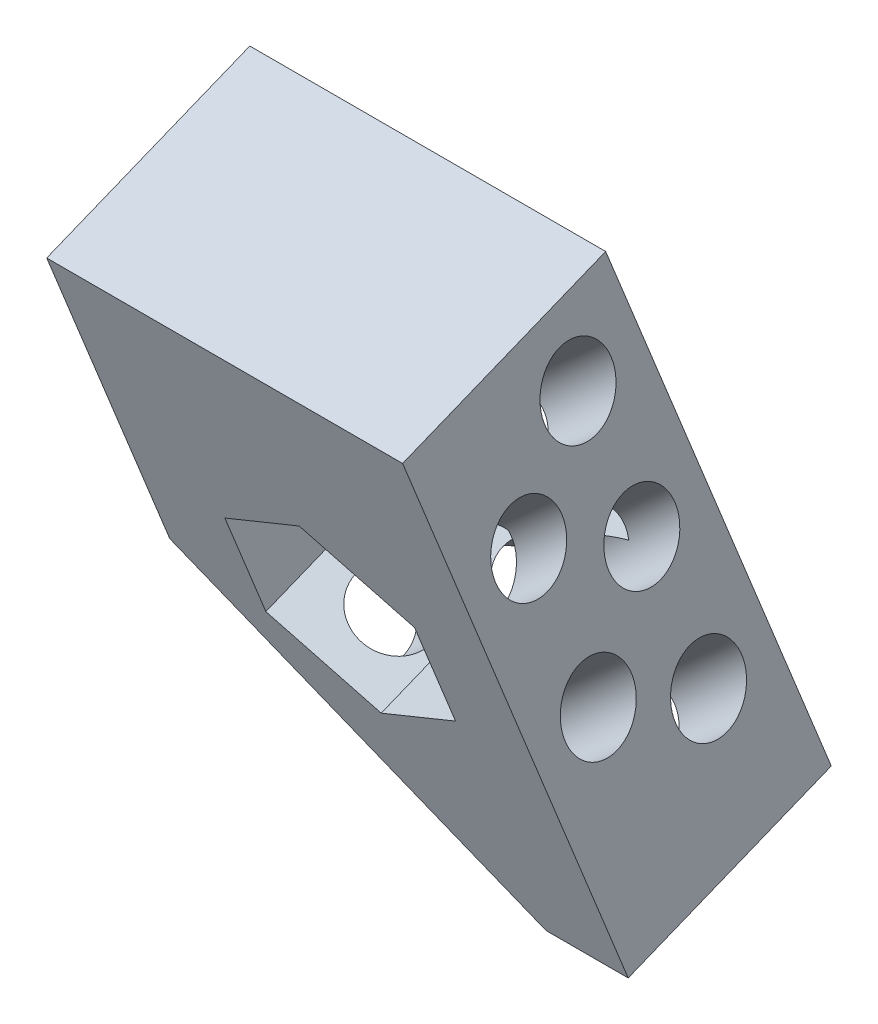
ISO-10303-21;
HEADER;
FILE_DESCRIPTION(('STEP AP214'),'2;1');
FILE_NAME('part.step','',(''),(''),'','','');
FILE_SCHEMA(('AUTOMOTIVE_DESIGN { 1 0 10303 214 1 1 1 1 }'));
ENDSEC;
DATA;
#1=APPLICATION_CONTEXT('core data for automotive mechanical design processes');
#2=APPLICATION_PROTOCOL_DEFINITION('international standard','automotive_design',2000,#1);
#3=PRODUCT_CONTEXT('',#1,'mechanical');
#4=PRODUCT('Part','Part','',(#3));
#5=PRODUCT_RELATED_PRODUCT_CATEGORY('part','',(#4));
#6=PRODUCT_DEFINITION_FORMATION('','',#4);
#7=PRODUCT_DEFINITION_CONTEXT('part definition',#1,'design');
#8=PRODUCT_DEFINITION('design','',#6,#7);
#9=PRODUCT_DEFINITION_SHAPE('','',#8);
#10=(LENGTH_UNIT() NAMED_UNIT(*) SI_UNIT(.MILLI.,.METRE.));
#11=(NAMED_UNIT(*) PLANE_ANGLE_UNIT() SI_UNIT($,.RADIAN.));
#12=(NAMED_UNIT(*) SI_UNIT($,.STERADIAN.) SOLID_ANGLE_UNIT());
#13=UNCERTAINTY_MEASURE_WITH_UNIT(LENGTH_MEASURE(1.E-05),#10,'distance_accuracy_value','');
#14=(GEOMETRIC_REPRESENTATION_CONTEXT(3) GLOBAL_UNCERTAINTY_ASSIGNED_CONTEXT((#13)) GLOBAL_UNIT_ASSIGNED_CONTEXT((#10,
#11,#12)) REPRESENTATION_CONTEXT('',''));
#15=CARTESIAN_POINT('',(0.,0.,0.));
#16=DIRECTION('',(0.,0.,1.));
#17=DIRECTION('',(1.,0.,0.));
#18=AXIS2_PLACEMENT_3D('',#15,#16,#17);
#19=CARTESIAN_POINT('',(22.8313600154402,-3.79206875254151,-14.4745121383278));
#20=DIRECTION('',(-0.707106781186546,-0.655617990970857,-0.264886862481586));
#21=DIRECTION('',(0.679904521866933,-0.733300648537076,0.));
#22=AXIS2_PLACEMENT_3D('',#19,#20,#21);
#23=CYLINDRICAL_SURFACE('',#22,6.50000000000001);
#24=CARTESIAN_POINT('',(-39.1198183419776,-61.2322010969268,-37.681832020902));
#25=DIRECTION('',(-0.5,-0.802964772033613,-0.324418826323332));
#26=DIRECTION('',(-0.866025403784439,0.463591927283392,0.187303296707959));
#27=AXIS2_PLACEMENT_3D('',#24,#25,#26);
#28=ELLIPSE('',#27,6.72929517266554,6.50000000000001);
#29=CARTESIAN_POINT('',(-44.94755891107,-58.1125541785719,-36.4214128505408));
#30=VERTEX_POINT('',#29);
#31=EDGE_CURVE('E177',#30,#30,#28,.F.);
#32=ORIENTED_EDGE('',*,*,#31,.T.);
#33=EDGE_LOOP('',(#32));
#34=FACE_BOUND('',#33,.T.);
#35=CARTESIAN_POINT('',(-46.6152236891497,-68.1818199182584,-40.4896602842776));
#36=DIRECTION('',(-0.707106781186546,-0.655617990970857,-0.264886862481586));
#37=DIRECTION('',(0.679904521866933,-0.733300648537077,0.));
#38=AXIS2_PLACEMENT_3D('',#35,#36,#37);
#39=CIRCLE('',#38,6.50000000000001);
#40=CARTESIAN_POINT('',(-42.1958442970147,-72.9482741337494,-40.4896602842776));
#41=VERTEX_POINT('',#40);
#42=EDGE_CURVE('E220',#41,#41,#39,.T.);
#43=ORIENTED_EDGE('',*,*,#42,.T.);
#44=EDGE_LOOP('',(#43));
#45=FACE_BOUND('',#44,.T.);
#46=ADVANCED_FACE('F35',(#34,#45),#23,.F.);
#47=CARTESIAN_POINT('',(15.0531854223881,9.41343464279255,-26.395698324099));
#48=DIRECTION('',(-0.707106781186546,-0.655617990970857,-0.264886862481586));
#49=DIRECTION('',(0.679904521866933,-0.733300648537076,0.));
#50=AXIS2_PLACEMENT_3D('',#47,#48,#49);
#51=CYLINDRICAL_SURFACE('',#50,6.50000000000001);
#52=CARTESIAN_POINT('',(-23.6231646872038,-26.4466527323936,-40.8841140844146));
#53=DIRECTION('',(0.5,0.802964772033613,0.324418826323332));
#54=DIRECTION('',(-0.866025403784439,0.463591927283393,0.187303296707959));
#55=AXIS2_PLACEMENT_3D('',#52,#53,#54);
#56=ELLIPSE('',#55,6.72929517266554,6.50000000000001);
#57=CARTESIAN_POINT('',(-29.4509052562962,-23.3270058140387,-39.6236949140533));
#58=VERTEX_POINT('',#57);
#59=EDGE_CURVE('E196',#58,#58,#56,.F.);
#60=ORIENTED_EDGE('',*,*,#59,.T.);
#61=EDGE_LOOP('',(#60));
#62=FACE_BOUND('',#61,.T.);
#63=CARTESIAN_POINT('',(0.,-4.54363584064589,-32.0347208352379));
#64=DIRECTION('',(-1.,0.,0.));
#65=DIRECTION('',(0.,-0.927183854566786,-0.374606593415916));
#66=AXIS2_PLACEMENT_3D('',#63,#64,#65);
#67=ELLIPSE('',#66,9.19238815542515,6.50000000000001);
#68=CARTESIAN_POINT('',(0.,-13.066669723267,-35.4782500474986));
#69=VERTEX_POINT('',#68);
#70=EDGE_CURVE('E217',#69,#69,#67,.T.);
#71=ORIENTED_EDGE('',*,*,#70,.F.);
#72=EDGE_LOOP('',(#71));
#73=FACE_BOUND('',#72,.T.);
#74=ADVANCED_FACE('F350',(#62,#73),#51,.F.);
#75=CARTESIAN_POINT('',(0.,14.9842637366366,-37.0873541826714));
#76=DIRECTION('',(0.,-0.927183854566786,-0.374606593415916));
#77=DIRECTION('',(0.,0.374606593415916,-0.927183854566786));
#78=AXIS2_PLACEMENT_3D('',#75,#76,#77);
#79=PLANE('',#78);
#80=DIRECTION('',(1.,0.,0.));
#81=VECTOR('',#80,1.);
#82=CARTESIAN_POINT('',(0.,0.,0.));
#83=LINE('',#82,#81);
#84=CARTESIAN_POINT('',(-65.,0.,0.));
#85=VERTEX_POINT('',#84);
#86=CARTESIAN_POINT('',(0.,0.,0.));
#87=VERTEX_POINT('',#86);
#88=EDGE_CURVE('E238',#85,#87,#83,.T.);
#89=ORIENTED_EDGE('',*,*,#88,.T.);
#90=DIRECTION('',(0.,-0.374606593415916,0.927183854566786));
#91=VECTOR('',#90,1.);
#92=CARTESIAN_POINT('',(0.,14.9842637366366,-37.0873541826714));
#93=LINE('',#92,#91);
#94=CARTESIAN_POINT('',(0.,14.9842637366366,-37.0873541826714));
#95=VERTEX_POINT('',#94);
#96=EDGE_CURVE('E264',#95,#87,#93,.T.);
#97=ORIENTED_EDGE('',*,*,#96,.F.);
#98=DIRECTION('',(1.,0.,0.));
#99=VECTOR('',#98,1.);
#100=CARTESIAN_POINT('',(0.,14.9842637366366,-37.0873541826714));
#101=LINE('',#100,#99);
#102=CARTESIAN_POINT('',(-65.,14.9842637366366,-37.0873541826714));
#103=VERTEX_POINT('',#102);
#104=EDGE_CURVE('E239',#103,#95,#101,.T.);
#105=ORIENTED_EDGE('',*,*,#104,.F.);
#106=DIRECTION('',(0.,-0.374606593415916,0.927183854566786));
#107=VECTOR('',#106,1.);
#108=CARTESIAN_POINT('',(-65.,14.9842637366366,-37.0873541826714));
#109=LINE('',#108,#107);
#110=EDGE_CURVE('E250',#103,#85,#109,.T.);
#111=ORIENTED_EDGE('',*,*,#110,.T.);
#112=EDGE_LOOP('',(#89,#97,#105,#111));
#113=FACE_BOUND('',#112,.T.);
#114=ADVANCED_FACE('F325',(#113),#79,.F.);
#115=CARTESIAN_POINT('',(0.,14.9842637366366,-37.0873541826714));
#116=DIRECTION('',(-1.,0.,0.));
#117=DIRECTION('',(0.,0.,1.));
#118=AXIS2_PLACEMENT_3D('',#115,#116,#117);
#119=PLANE('',#118);
#120=CARTESIAN_POINT('',(0.,-63.549255028023,-55.8745384585807));
#121=DIRECTION('',(-1.,0.,0.));
#122=DIRECTION('',(0.,-0.927183854566786,-0.374606593415916));
#123=AXIS2_PLACEMENT_3D('',#120,#121,#122);
#124=ELLIPSE('',#123,9.19238815542511,6.49999999999998);
#125=CARTESIAN_POINT('',(0.,-72.0722889106441,-59.3180676708413));
#126=VERTEX_POINT('',#125);
#127=EDGE_CURVE('E211',#126,#126,#124,.T.);
#128=ORIENTED_EDGE('',*,*,#127,.T.);
#129=EDGE_LOOP('',(#128));
#130=FACE_BOUND('',#129,.T.);
#131=ORIENTED_EDGE('',*,*,#70,.T.);
#132=EDGE_LOOP('',(#131));
#133=FACE_BOUND('',#132,.T.);
#134=CARTESIAN_POINT('',(0.,-24.9609371366594,-23.0272901367643));
#135=DIRECTION('',(-1.,0.,0.));
#136=DIRECTION('',(0.,-0.927183854566786,-0.374606593415916));
#137=AXIS2_PLACEMENT_3D('',#134,#135,#136);
#138=ELLIPSE('',#137,9.19238815542515,6.50000000000001);
#139=CARTESIAN_POINT('',(0.,-33.4839710192806,-26.4708193490249));
#140=VERTEX_POINT('',#139);
#141=EDGE_CURVE('E223',#140,#140,#138,.T.);
#142=ORIENTED_EDGE('',*,*,#141,.T.);
#143=EDGE_LOOP('',(#142));
#144=FACE_BOUND('',#143,.T.);
#145=CARTESIAN_POINT('',(0.,-33.3908274433636,-43.6897427844278));
#146=DIRECTION('',(-1.,0.,0.));
#147=DIRECTION('',(0.,-0.927183854566786,-0.374606593415916));
#148=AXIS2_PLACEMENT_3D('',#145,#146,#147);
#149=ELLIPSE('',#148,9.19238815542515,6.50000000000001);
#150=CARTESIAN_POINT('',(0.,-41.9138613259848,-47.1332719966884));
#151=VERTEX_POINT('',#150);
#152=EDGE_CURVE('E229',#151,#151,#149,.T.);
#153=ORIENTED_EDGE('',*,*,#152,.T.);
#154=EDGE_LOOP('',(#153));
#155=FACE_BOUND('',#154,.T.);
#156=CARTESIAN_POINT('',(0.,-56.4306007032606,-35.7418595358804));
#157=DIRECTION('',(-1.,0.,0.));
#158=DIRECTION('',(0.,-0.927183854566786,-0.374606593415916));
#159=AXIS2_PLACEMENT_3D('',#156,#157,#158);
#160=ELLIPSE('',#159,9.19238815542515,6.50000000000001);
#161=CARTESIAN_POINT('',(0.,-64.9536345858817,-39.185388748141));
#162=VERTEX_POINT('',#161);
#163=EDGE_CURVE('E235',#162,#162,#160,.T.);
#164=ORIENTED_EDGE('',*,*,#163,.T.);
#165=EDGE_LOOP('',(#164));
#166=FACE_BOUND('',#165,.T.);
#167=DIRECTION('',(0.,-0.927183854566786,-0.374606593415916));
#168=VECTOR('',#167,1.);
#169=CARTESIAN_POINT('',(0.,0.,0.));
#170=LINE('',#169,#168);
#171=CARTESIAN_POINT('',(0.,-101.990224002346,-41.2067252757508));
#172=VERTEX_POINT('',#171);
#173=EDGE_CURVE('E253',#87,#172,#170,.T.);
#174=ORIENTED_EDGE('',*,*,#173,.T.);
#175=DIRECTION('',(0.,-0.374606593415916,0.927183854566786));
#176=VECTOR('',#175,1.);
#177=CARTESIAN_POINT('',(0.,-87.0059602657098,-78.2940794584222));
#178=LINE('',#177,#176);
#179=CARTESIAN_POINT('',(0.,-87.0059602657098,-78.2940794584222));
#180=VERTEX_POINT('',#179);
#181=EDGE_CURVE('E261',#180,#172,#178,.T.);
#182=ORIENTED_EDGE('',*,*,#181,.F.);
#183=DIRECTION('',(0.,-0.927183854566786,-0.374606593415916));
#184=VECTOR('',#183,1.);
#185=CARTESIAN_POINT('',(0.,14.9842637366366,-37.0873541826714));
#186=LINE('',#185,#184);
#187=EDGE_CURVE('E242',#95,#180,#186,.T.);
#188=ORIENTED_EDGE('',*,*,#187,.F.);
#189=ORIENTED_EDGE('',*,*,#96,.T.);
#190=EDGE_LOOP('',(#174,#182,#188,#189));
#191=FACE_BOUND('',#190,.T.);
#192=ADVANCED_FACE('F321',(#130,#133,#144,#155,#166,#191),#119,.F.);
#193=CARTESIAN_POINT('',(0.,-87.0059602657098,-78.2940794584222));
#194=DIRECTION('',(0.,0.927183854566786,0.374606593415916));
#195=DIRECTION('',(0.,-0.374606593415916,0.927183854566786));
#196=AXIS2_PLACEMENT_3D('',#193,#194,#195);
#197=PLANE('',#196);
#198=DIRECTION('',(-1.,0.,0.));
#199=VECTOR('',#198,1.);
#200=CARTESIAN_POINT('',(0.,-101.990224002346,-41.2067252757508));
#201=LINE('',#200,#199);
#202=CARTESIAN_POINT('',(-14.9999999999998,-101.990224002346,-41.2067252757508));
#203=VERTEX_POINT('',#202);
#204=EDGE_CURVE('E255',#172,#203,#201,.T.);
#205=ORIENTED_EDGE('',*,*,#204,.T.);
#206=DIRECTION('',(0.,0.374606593415916,-0.927183854566786));
#207=VECTOR('',#206,1.);
#208=CARTESIAN_POINT('',(-14.9999999999998,-87.0059602657098,-78.2940794584222));
#209=LINE('',#208,#207);
#210=CARTESIAN_POINT('',(-14.9999999999998,-87.0059602657098,-78.2940794584222));
#211=VERTEX_POINT('',#210);
#212=EDGE_CURVE('E272',#203,#211,#209,.T.);
#213=ORIENTED_EDGE('',*,*,#212,.T.);
#214=DIRECTION('',(-1.,0.,0.));
#215=VECTOR('',#214,1.);
#216=CARTESIAN_POINT('',(0.,-87.0059602657098,-78.2940794584222));
#217=LINE('',#216,#215);
#218=EDGE_CURVE('E245',#180,#211,#217,.T.);
#219=ORIENTED_EDGE('',*,*,#218,.F.);
#220=ORIENTED_EDGE('',*,*,#181,.T.);
#221=EDGE_LOOP('',(#205,#213,#219,#220));
#222=FACE_BOUND('',#221,.T.);
#223=ADVANCED_FACE('F324',(#222),#197,.F.);
#224=CARTESIAN_POINT('',(-65.,14.9842637366366,-37.0873541826714));
#225=DIRECTION('',(1.,0.,0.));
#226=DIRECTION('',(0.,0.,-1.));
#227=AXIS2_PLACEMENT_3D('',#224,#225,#226);
#228=PLANE('',#227);
#229=DIRECTION('',(0.,0.927183854566786,0.374606593415916));
#230=VECTOR('',#229,1.);
#231=CARTESIAN_POINT('',(-65.,14.9842637366366,-37.0873541826714));
#232=LINE('',#231,#230);
#233=CARTESIAN_POINT('',(-65.,-40.6467675373705,-59.5637497876264));
#234=VERTEX_POINT('',#233);
#235=EDGE_CURVE('E248',#234,#103,#232,.T.);
#236=ORIENTED_EDGE('',*,*,#235,.F.);
#237=DIRECTION('',(0.,-0.374606593415916,0.927183854566786));
#238=VECTOR('',#237,1.);
#239=CARTESIAN_POINT('',(-65.,-40.6467675373705,-59.5637497876264));
#240=LINE('',#239,#238);
#241=CARTESIAN_POINT('',(-65.,-55.6310312740071,-22.476395604955));
#242=VERTEX_POINT('',#241);
#243=EDGE_CURVE('E267',#234,#242,#240,.T.);
#244=ORIENTED_EDGE('',*,*,#243,.T.);
#245=DIRECTION('',(0.,0.927183854566786,0.374606593415916));
#246=VECTOR('',#245,1.);
#247=CARTESIAN_POINT('',(-65.,0.,0.));
#248=LINE('',#247,#246);
#249=EDGE_CURVE('E243',#242,#85,#248,.T.);
#250=ORIENTED_EDGE('',*,*,#249,.T.);
#251=ORIENTED_EDGE('',*,*,#110,.F.);
#252=EDGE_LOOP('',(#236,#244,#250,#251));
#253=FACE_BOUND('',#252,.T.);
#254=ADVANCED_FACE('F345',(#253),#228,.F.);
#255=CARTESIAN_POINT('',(0.,14.9842637366366,-37.0873541826714));
#256=DIRECTION('',(0.,-0.374606593415916,0.927183854566786));
#257=DIRECTION('',(0.,-0.927183854566786,-0.374606593415916));
#258=AXIS2_PLACEMENT_3D('',#255,#256,#257);
#259=PLANE('',#258);
#260=DIRECTION('',(0.,-0.927183854566786,-0.374606593415916));
#261=VECTOR('',#260,1.);
#262=CARTESIAN_POINT('',(-14.6794919243113,-26.7390097188688,-53.9446508863877));
#263=LINE('',#262,#261);
#264=CARTESIAN_POINT('',(-14.6794919243113,-26.7390097188687,-53.9446508863877));
#265=VERTEX_POINT('',#264);
#266=CARTESIAN_POINT('',(-14.6794919243113,-45.2826868102045,-61.436782754706));
#267=VERTEX_POINT('',#266);
#268=EDGE_CURVE('E155',#265,#267,#263,.T.);
#269=ORIENTED_EDGE('',*,*,#268,.F.);
#270=DIRECTION('',(0.866025403784439,-0.463591927283393,-0.187303296707958));
#271=VECTOR('',#270,1.);
#272=CARTESIAN_POINT('',(-32.,-17.4671711732009,-50.1985849522285));
#273=LINE('',#272,#271);
#274=CARTESIAN_POINT('',(-32.,-17.4671711732009,-50.1985849522285));
#275=VERTEX_POINT('',#274);
#276=EDGE_CURVE('E50',#275,#265,#273,.T.);
#277=ORIENTED_EDGE('',*,*,#276,.F.);
#278=DIRECTION('',(0.866025403784439,0.463591927283393,0.187303296707958));
#279=VECTOR('',#278,1.);
#280=CARTESIAN_POINT('',(-49.3205080756888,-26.7390097188688,-53.9446508863877));
#281=LINE('',#280,#279);
#282=CARTESIAN_POINT('',(-49.3205080756888,-26.7390097188688,-53.9446508863877));
#283=VERTEX_POINT('',#282);
#284=EDGE_CURVE('E172',#283,#275,#281,.T.);
#285=ORIENTED_EDGE('',*,*,#284,.F.);
#286=DIRECTION('',(0.,0.927183854566786,0.374606593415916));
#287=VECTOR('',#286,1.);
#288=CARTESIAN_POINT('',(-49.3205080756888,-45.2826868102045,-61.436782754706));
#289=LINE('',#288,#287);
#290=CARTESIAN_POINT('',(-49.3205080756888,-45.2826868102045,-61.436782754706));
#291=VERTEX_POINT('',#290);
#292=EDGE_CURVE('E166',#291,#283,#289,.T.);
#293=ORIENTED_EDGE('',*,*,#292,.F.);
#294=DIRECTION('',(-0.866025403784439,0.463591927283393,0.187303296707958));
#295=VECTOR('',#294,1.);
#296=CARTESIAN_POINT('',(-32.,-54.5545253558723,-65.1828486888652));
#297=LINE('',#296,#295);
#298=CARTESIAN_POINT('',(-32.,-54.5545253558723,-65.1828486888652));
#299=VERTEX_POINT('',#298);
#300=EDGE_CURVE('E164',#299,#291,#297,.T.);
#301=ORIENTED_EDGE('',*,*,#300,.F.);
#302=DIRECTION('',(-0.866025403784438,-0.463591927283393,-0.187303296707958));
#303=VECTOR('',#302,1.);
#304=CARTESIAN_POINT('',(-14.6794919243113,-45.2826868102045,-61.436782754706));
#305=LINE('',#304,#303);
#306=EDGE_CURVE('E147',#267,#299,#305,.T.);
#307=ORIENTED_EDGE('',*,*,#306,.F.);
#308=EDGE_LOOP('',(#269,#277,#285,#293,#301,#307));
#309=FACE_BOUND('',#308,.T.);
#310=ORIENTED_EDGE('',*,*,#218,.T.);
#311=DIRECTION('',(0.707106781186549,-0.655617990970855,-0.264886862481586));
#312=VECTOR('',#311,1.);
#313=CARTESIAN_POINT('',(-65.,-40.6467675373705,-59.5637497876264));
#314=LINE('',#313,#312);
#315=EDGE_CURVE('E274',#211,#234,#314,.F.);
#316=ORIENTED_EDGE('',*,*,#315,.T.);
#317=ORIENTED_EDGE('',*,*,#235,.T.);
#318=ORIENTED_EDGE('',*,*,#104,.T.);
#319=ORIENTED_EDGE('',*,*,#187,.T.);
#320=EDGE_LOOP('',(#310,#316,#317,#318,#319));
#321=FACE_BOUND('',#320,.T.);
#322=ADVANCED_FACE('F160',(#309,#321),#259,.F.);
#323=CARTESIAN_POINT('',(0.,0.,0.));
#324=DIRECTION('',(0.,-0.374606593415916,0.927183854566786));
#325=DIRECTION('',(0.,-0.927183854566786,-0.374606593415916));
#326=AXIS2_PLACEMENT_3D('',#323,#324,#325);
#327=PLANE('',#326);
#328=DIRECTION('',(-0.866025403784439,0.463591927283393,0.187303296707958));
#329=VECTOR('',#328,1.);
#330=CARTESIAN_POINT('',(-23.1554445662277,-37.186012534916,-15.0241242983411));
#331=LINE('',#330,#329);
#332=CARTESIAN_POINT('',(-14.6794919243113,-41.7232734555054,-16.8572967037162));
#333=VERTEX_POINT('',#332);
#334=CARTESIAN_POINT('',(-32.,-32.4514349098376,-13.1112307695571));
#335=VERTEX_POINT('',#334);
#336=EDGE_CURVE('E200',#333,#335,#331,.T.);
#337=ORIENTED_EDGE('',*,*,#336,.F.);
#338=DIRECTION('',(0.,0.927183854566786,0.374606593415916));
#339=VECTOR('',#338,1.);
#340=CARTESIAN_POINT('',(-14.6794919243113,0.,0.));
#341=LINE('',#340,#339);
#342=CARTESIAN_POINT('',(-14.6794919243113,-60.2669505468411,-24.3494285720346));
#343=VERTEX_POINT('',#342);
#344=EDGE_CURVE('E204',#343,#333,#341,.T.);
#345=ORIENTED_EDGE('',*,*,#344,.F.);
#346=DIRECTION('',(0.866025403784438,0.463591927283393,0.187303296707958));
#347=VECTOR('',#346,1.);
#348=CARTESIAN_POINT('',(24.4759526419165,-39.3066554668439,-15.880919658472));
#349=LINE('',#348,#347);
#350=CARTESIAN_POINT('',(-32.,-69.538789092509,-28.0954945061937));
#351=VERTEX_POINT('',#350);
#352=EDGE_CURVE('E206',#351,#343,#349,.T.);
#353=ORIENTED_EDGE('',*,*,#352,.F.);
#354=DIRECTION('',(0.866025403784439,-0.463591927283393,-0.187303296707958));
#355=VECTOR('',#354,1.);
#356=CARTESIAN_POINT('',(-40.4759526419164,-65.0015281719195,-26.2623221008186));
#357=LINE('',#356,#355);
#358=CARTESIAN_POINT('',(-49.3205080756888,-60.2669505468411,-24.3494285720345));
#359=VERTEX_POINT('',#358);
#360=EDGE_CURVE('E192',#359,#351,#357,.T.);
#361=ORIENTED_EDGE('',*,*,#360,.F.);
#362=DIRECTION('',(0.,-0.927183854566786,-0.374606593415916));
#363=VECTOR('',#362,1.);
#364=CARTESIAN_POINT('',(-49.3205080756888,0.,0.));
#365=LINE('',#364,#363);
#366=CARTESIAN_POINT('',(-49.3205080756888,-41.7232734555054,-16.8572967037162));
#367=VERTEX_POINT('',#366);
#368=EDGE_CURVE('E194',#367,#359,#365,.T.);
#369=ORIENTED_EDGE('',*,*,#368,.F.);
#370=DIRECTION('',(-0.866025403784439,-0.463591927283393,-0.187303296707958));
#371=VECTOR('',#370,1.);
#372=CARTESIAN_POINT('',(7.1554445662277,-11.4911398298404,-4.64272185599451));
#373=LINE('',#372,#371);
#374=EDGE_CURVE('E11',#335,#367,#373,.T.);
#375=ORIENTED_EDGE('',*,*,#374,.F.);
#376=EDGE_LOOP('',(#337,#345,#353,#361,#369,#375));
#377=FACE_BOUND('',#376,.T.);
#378=ORIENTED_EDGE('',*,*,#249,.F.);
#379=DIRECTION('',(-0.707106781186549,0.655617990970855,0.264886862481586));
#380=VECTOR('',#379,1.);
#381=CARTESIAN_POINT('',(-62.4999999999999,-57.9489909104242,-23.4129120884948));
#382=LINE('',#381,#380);
#383=EDGE_CURVE('E270',#242,#203,#382,.F.);
#384=ORIENTED_EDGE('',*,*,#383,.T.);
#385=ORIENTED_EDGE('',*,*,#204,.F.);
#386=ORIENTED_EDGE('',*,*,#173,.F.);
#387=ORIENTED_EDGE('',*,*,#88,.F.);
#388=EDGE_LOOP('',(#378,#384,#385,#386,#387));
#389=FACE_BOUND('',#388,.T.);
#390=ADVANCED_FACE('F304',(#377,#389),#327,.T.);
#391=CARTESIAN_POINT('',(-65.,-40.6467675373705,-59.5637497876264));
#392=DIRECTION('',(0.707106781186546,0.655617990970857,0.264886862481586));
#393=DIRECTION('',(0.,-0.374606593415916,0.927183854566786));
#394=AXIS2_PLACEMENT_3D('',#391,#392,#393);
#395=PLANE('',#394);
#396=CARTESIAN_POINT('',(-22.5735931288071,-84.4791261166127,-64.3307552817201));
#397=DIRECTION('',(-0.707106781186546,-0.655617990970857,-0.264886862481586));
#398=DIRECTION('',(0.679904521866933,-0.733300648537077,0.));
#399=AXIS2_PLACEMENT_3D('',#396,#397,#398);
#400=CIRCLE('',#399,6.49999999999998);
#401=CARTESIAN_POINT('',(-18.154213736672,-89.2455803321037,-64.3307552817201));
#402=VERTEX_POINT('',#401);
#403=EDGE_CURVE('E208',#402,#402,#400,.T.);
#404=ORIENTED_EDGE('',*,*,#403,.F.);
#405=EDGE_LOOP('',(#404));
#406=FACE_BOUND('',#405,.T.);
#407=CARTESIAN_POINT('',(-54.3933982822018,-54.9763165229243,-52.4108464700487));
#408=DIRECTION('',(-0.707106781186546,-0.655617990970857,-0.264886862481586));
#409=DIRECTION('',(0.679904521866933,-0.733300648537077,0.));
#410=AXIS2_PLACEMENT_3D('',#407,#408,#409);
#411=CIRCLE('',#410,6.50000000000001);
#412=CARTESIAN_POINT('',(-49.9740188900667,-59.7427707384153,-52.4108464700487));
#413=VERTEX_POINT('',#412);
#414=EDGE_CURVE('E214',#413,#413,#411,.T.);
#415=ORIENTED_EDGE('',*,*,#414,.F.);
#416=EDGE_LOOP('',(#415));
#417=FACE_BOUND('',#416,.T.);
#418=ORIENTED_EDGE('',*,*,#42,.F.);
#419=EDGE_LOOP('',(#418));
#420=FACE_BOUND('',#419,.T.);
#421=CARTESIAN_POINT('',(-38.8370490960977,-69.3999123242831,-58.2383574446436));
#422=DIRECTION('',(-0.707106781186546,-0.655617990970857,-0.264886862481586));
#423=DIRECTION('',(0.679904521866933,-0.733300648537077,0.));
#424=AXIS2_PLACEMENT_3D('',#421,#422,#423);
#425=CIRCLE('',#424,6.50000000000001);
#426=CARTESIAN_POINT('',(-34.4176697039626,-74.1663665397741,-58.2383574446436));
#427=VERTEX_POINT('',#426);
#428=EDGE_CURVE('E226',#427,#427,#425,.T.);
#429=ORIENTED_EDGE('',*,*,#428,.F.);
#430=EDGE_LOOP('',(#429));
#431=FACE_BOUND('',#430,.T.);
#432=CARTESIAN_POINT('',(-29.6446609406726,-83.9166517015589,-46.8469449838356));
#433=DIRECTION('',(-0.707106781186546,-0.655617990970857,-0.264886862481586));
#434=DIRECTION('',(0.679904521866933,-0.733300648537077,0.));
#435=AXIS2_PLACEMENT_3D('',#432,#433,#434);
#436=CIRCLE('',#435,6.50000000000001);
#437=CARTESIAN_POINT('',(-25.2252815485375,-88.6831059170499,-46.8469449838356));
#438=VERTEX_POINT('',#437);
#439=EDGE_CURVE('E232',#438,#438,#436,.T.);
#440=ORIENTED_EDGE('',*,*,#439,.F.);
#441=EDGE_LOOP('',(#440));
#442=FACE_BOUND('',#441,.T.);
#443=ORIENTED_EDGE('',*,*,#315,.F.);
#444=ORIENTED_EDGE('',*,*,#212,.F.);
#445=ORIENTED_EDGE('',*,*,#383,.F.);
#446=ORIENTED_EDGE('',*,*,#243,.F.);
#447=EDGE_LOOP('',(#443,#444,#445,#446));
#448=FACE_BOUND('',#447,.T.);
#449=ADVANCED_FACE('F37',(#406,#417,#420,#431,#442,#448),#395,.F.);
#450=CARTESIAN_POINT('',(39.8019227639173,-19.526900535842,-20.8317968378859));
#451=DIRECTION('',(-0.707106781186546,-0.655617990970857,-0.264886862481586));
#452=DIRECTION('',(0.679904521866933,-0.733300648537076,0.));
#453=AXIS2_PLACEMENT_3D('',#450,#451,#452);
#454=CYLINDRICAL_SURFACE('',#453,6.50000000000001);
#455=ORIENTED_EDGE('',*,*,#439,.T.);
#456=EDGE_LOOP('',(#455));
#457=FACE_BOUND('',#456,.T.);
#458=ORIENTED_EDGE('',*,*,#163,.F.);
#459=EDGE_LOOP('',(#458));
#460=FACE_BOUND('',#459,.T.);
#461=ADVANCED_FACE('F365',(#457,#460),#454,.F.);
#462=CARTESIAN_POINT('',(30.6095346084922,-5.01016115856626,-32.2232092986939));
#463=DIRECTION('',(-0.707106781186546,-0.655617990970857,-0.264886862481586));
#464=DIRECTION('',(0.679904521866933,-0.733300648537076,0.));
#465=AXIS2_PLACEMENT_3D('',#462,#463,#464);
#466=CYLINDRICAL_SURFACE('',#465,6.50000000000001);
#467=CARTESIAN_POINT('',(-21.7648064284577,-53.570804561601,-51.8429827769491));
#468=DIRECTION('',(0.5,-0.802964772033613,-0.324418826323332));
#469=DIRECTION('',(-0.866025403784438,-0.463591927283393,-0.187303296707958));
#470=AXIS2_PLACEMENT_3D('',#467,#468,#469);
#471=ELLIPSE('',#470,25.1140714835157,6.50000000000001);
#472=CARTESIAN_POINT('',(-14.6794919243113,-47.4758516993988,-56.0085091700871));
#473=VERTEX_POINT('',#472);
#474=CARTESIAN_POINT('',(-32.,-56.9013356693538,-59.3742893345053));
#475=VERTEX_POINT('',#474);
#476=EDGE_CURVE('E150',#473,#475,#471,.F.);
#477=ORIENTED_EDGE('',*,*,#476,.T.);
#478=CARTESIAN_POINT('',(-29.257488148129,-60.517898079488,-54.6497907515049));
#479=DIRECTION('',(-0.5,-0.802964772033613,-0.324418826323332));
#480=DIRECTION('',(-0.866025403784439,0.463591927283392,0.187303296707959));
#481=AXIS2_PLACEMENT_3D('',#478,#479,#480);
#482=ELLIPSE('',#481,6.72929517266554,6.50000000000001);
#483=CARTESIAN_POINT('',(-32.,-61.1982732843728,-48.7389955336221));
#484=VERTEX_POINT('',#483);
#485=EDGE_CURVE('E189',#475,#484,#482,.F.);
#486=ORIENTED_EDGE('',*,*,#485,.T.);
#487=CARTESIAN_POINT('',(-14.6794919243113,-52.0800801629922,-44.612643829722));
#488=VERTEX_POINT('',#487);
#489=EDGE_CURVE('E43',#484,#488,#471,.F.);
#490=ORIENTED_EDGE('',*,*,#489,.T.);
#491=CARTESIAN_POINT('',(-14.6794919243113,-47.0014153488286,-49.1887772472705));
#492=DIRECTION('',(1.,0.,0.));
#493=DIRECTION('',(0.,-0.927183854566786,-0.374606593415916));
#494=AXIS2_PLACEMENT_3D('',#491,#492,#493);
#495=ELLIPSE('',#494,9.19238815542514,6.50000000000001);
#496=EDGE_CURVE('E202',#488,#473,#495,.F.);
#497=ORIENTED_EDGE('',*,*,#496,.T.);
#498=EDGE_LOOP('',(#477,#486,#490,#497));
#499=FACE_BOUND('',#498,.T.);
#500=ORIENTED_EDGE('',*,*,#428,.T.);
#501=EDGE_LOOP('',(#500));
#502=FACE_BOUND('',#501,.T.);
#503=ORIENTED_EDGE('',*,*,#152,.F.);
#504=EDGE_LOOP('',(#503));
#505=FACE_BOUND('',#504,.T.);
#506=ADVANCED_FACE('F288',(#499,#502,#505),#466,.F.);
#507=CARTESIAN_POINT('',(-14.6794919243113,-38.5715250421244,-28.526324599607));
#508=DIRECTION('',(1.,0.,0.));
#509=DIRECTION('',(0.,-0.927183854566786,-0.374606593415916));
#510=AXIS2_PLACEMENT_3D('',#507,#508,#509);
#511=ELLIPSE('',#510,9.19238815542514,6.50000000000001);
#512=CARTESIAN_POINT('',(-14.6794919243113,-34.8234945838742,-33.9348486803698));
#513=VERTEX_POINT('',#512);
#514=CARTESIAN_POINT('',(-14.6794919243113,-39.6324940851546,-22.0321572366654));
#515=VERTEX_POINT('',#514);
#516=EDGE_CURVE('E282',#513,#515,#511,.F.);
#517=ORIENTED_EDGE('',*,*,#516,.T.);
#518=CARTESIAN_POINT('',(-13.7608344933552,-37.7197607042641,-28.1821894688803));
#519=DIRECTION('',(0.5,0.802964772033613,0.324418826323332));
#520=DIRECTION('',(-0.866025403784439,0.463591927283393,0.187303296707959));
#521=AXIS2_PLACEMENT_3D('',#518,#519,#520);
#522=ELLIPSE('',#521,6.72929517266554,6.50000000000001);
#523=EDGE_CURVE('E197',#515,#513,#522,.F.);
#524=ORIENTED_EDGE('',*,*,#523,.T.);
#525=EDGE_LOOP('',(#517,#524));
#526=FACE_BOUND('',#525,.T.);
#527=ORIENTED_EDGE('',*,*,#141,.F.);
#528=EDGE_LOOP('',(#527));
#529=FACE_BOUND('',#528,.T.);
#530=ADVANCED_FACE('F314',(#526,#529),#23,.F.);
#531=CARTESIAN_POINT('',(-48.9821485358262,-49.9590931250562,-50.3837566364363));
#532=DIRECTION('',(-0.5,-0.802964772033613,-0.324418826323332));
#533=DIRECTION('',(-0.866025403784439,0.463591927283392,0.187303296707959));
#534=AXIS2_PLACEMENT_3D('',#531,#532,#533);
#535=ELLIPSE('',#534,6.72929517266554,6.50000000000001);
#536=CARTESIAN_POINT('',(-49.3205080756888,-52.2088012496204,-44.294047960451));
#537=VERTEX_POINT('',#536);
#538=CARTESIAN_POINT('',(-49.3205080756888,-47.3471306127705,-56.3271050393581));
#539=VERTEX_POINT('',#538);
#540=EDGE_CURVE('E276',#537,#539,#535,.F.);
#541=ORIENTED_EDGE('',*,*,#540,.T.);
#542=CARTESIAN_POINT('',(-49.3205080756888,-50.2728146274555,-50.510508351014));
#543=DIRECTION('',(-1.,0.,0.));
#544=DIRECTION('',(0.,-0.927183854566786,-0.374606593415916));
#545=AXIS2_PLACEMENT_3D('',#542,#543,#544);
#546=ELLIPSE('',#545,9.19238815542514,6.50000000000001);
#547=EDGE_CURVE('E279',#539,#537,#546,.F.);
#548=ORIENTED_EDGE('',*,*,#547,.T.);
#549=EDGE_LOOP('',(#541,#548));
#550=FACE_BOUND('',#549,.T.);
#551=ORIENTED_EDGE('',*,*,#414,.T.);
#552=EDGE_LOOP('',(#551));
#553=FACE_BOUND('',#552,.T.);
#554=ADVANCED_FACE('F317',(#550,#553),#51,.F.);
#555=CARTESIAN_POINT('',(46.8729905757828,-20.0893749508959,-38.3156071357703));
#556=DIRECTION('',(-0.707106781186546,-0.655617990970857,-0.264886862481586));
#557=DIRECTION('',(0.679904521866933,-0.733300648537076,0.));
#558=AXIS2_PLACEMENT_3D('',#555,#556,#557);
#559=CYLINDRICAL_SURFACE('',#558,6.49999999999998);
#560=ORIENTED_EDGE('',*,*,#403,.T.);
#561=EDGE_LOOP('',(#560));
#562=FACE_BOUND('',#561,.T.);
#563=ORIENTED_EDGE('',*,*,#127,.F.);
#564=EDGE_LOOP('',(#563));
#565=FACE_BOUND('',#564,.T.);
#566=ADVANCED_FACE('F417',(#562,#565),#559,.F.);
#567=CARTESIAN_POINT('',(-14.6794919243113,-74.5792488628435,11.0747528320748));
#568=DIRECTION('',(0.5,-0.802964772033613,-0.324418826323332));
#569=DIRECTION('',(0.848877553910824,0.528589536849128,0.));
#570=AXIS2_PLACEMENT_3D('',#567,#568,#569);
#571=PLANE('',#570);
#572=ORIENTED_EDGE('',*,*,#352,.T.);
#573=DIRECTION('',(0.,0.374606593415916,-0.927183854566786));
#574=VECTOR('',#573,1.);
#575=CARTESIAN_POINT('',(-14.6794919243113,-74.5792488628435,11.0747528320748));
#576=LINE('',#575,#574);
#577=EDGE_CURVE('E58',#343,#488,#576,.T.);
#578=ORIENTED_EDGE('',*,*,#577,.T.);
#579=ORIENTED_EDGE('',*,*,#489,.F.);
#580=DIRECTION('',(0.,0.374606593415916,-0.927183854566786));
#581=VECTOR('',#580,1.);
#582=CARTESIAN_POINT('',(-32.,-83.8510874085114,7.32868689791565));
#583=LINE('',#582,#581);
#584=EDGE_CURVE('E183',#351,#484,#583,.T.);
#585=ORIENTED_EDGE('',*,*,#584,.F.);
#586=EDGE_LOOP('',(#572,#578,#579,#585));
#587=FACE_BOUND('',#586,.T.);
#588=ADVANCED_FACE('F293',(#587),#571,.F.);
#589=EDGE_CURVE('E142',#473,#267,#576,.T.);
#590=ORIENTED_EDGE('',*,*,#589,.T.);
#591=ORIENTED_EDGE('',*,*,#306,.T.);
#592=EDGE_CURVE('E184',#475,#299,#583,.T.);
#593=ORIENTED_EDGE('',*,*,#592,.F.);
#594=ORIENTED_EDGE('',*,*,#476,.F.);
#595=EDGE_LOOP('',(#590,#591,#593,#594));
#596=FACE_BOUND('',#595,.T.);
#597=ADVANCED_FACE('F144',(#596),#571,.F.);
#598=CARTESIAN_POINT('',(-14.6794919243113,-56.0355717715078,18.5668847003931));
#599=DIRECTION('',(1.,0.,0.));
#600=DIRECTION('',(0.,1.,0.));
#601=AXIS2_PLACEMENT_3D('',#598,#599,#600);
#602=PLANE('',#601);
#603=ORIENTED_EDGE('',*,*,#344,.T.);
#604=DIRECTION('',(0.,0.374606593415916,-0.927183854566786));
#605=VECTOR('',#604,1.);
#606=CARTESIAN_POINT('',(-14.6794919243113,-56.0355717715078,18.5668847003931));
#607=LINE('',#606,#605);
#608=EDGE_CURVE('E152',#333,#515,#607,.T.);
#609=ORIENTED_EDGE('',*,*,#608,.T.);
#610=ORIENTED_EDGE('',*,*,#516,.F.);
#611=EDGE_CURVE('E157',#513,#265,#607,.T.);
#612=ORIENTED_EDGE('',*,*,#611,.T.);
#613=ORIENTED_EDGE('',*,*,#268,.T.);
#614=ORIENTED_EDGE('',*,*,#589,.F.);
#615=ORIENTED_EDGE('',*,*,#496,.F.);
#616=ORIENTED_EDGE('',*,*,#577,.F.);
#617=EDGE_LOOP('',(#603,#609,#610,#612,#613,#614,#615,#616));
#618=FACE_BOUND('',#617,.T.);
#619=ADVANCED_FACE('F156',(#618),#602,.F.);
#620=CARTESIAN_POINT('',(-32.,-46.76373322584,22.3129506345523));
#621=DIRECTION('',(0.5,0.802964772033613,0.324418826323332));
#622=DIRECTION('',(-0.848877553910825,0.528589536849127,0.));
#623=AXIS2_PLACEMENT_3D('',#620,#621,#622);
#624=PLANE('',#623);
#625=ORIENTED_EDGE('',*,*,#336,.T.);
#626=DIRECTION('',(0.,0.374606593415916,-0.927183854566786));
#627=VECTOR('',#626,1.);
#628=CARTESIAN_POINT('',(-32.,-46.76373322584,22.3129506345523));
#629=LINE('',#628,#627);
#630=EDGE_CURVE('E175',#335,#275,#629,.T.);
#631=ORIENTED_EDGE('',*,*,#630,.T.);
#632=ORIENTED_EDGE('',*,*,#276,.T.);
#633=ORIENTED_EDGE('',*,*,#611,.F.);
#634=ORIENTED_EDGE('',*,*,#523,.F.);
#635=ORIENTED_EDGE('',*,*,#608,.F.);
#636=EDGE_LOOP('',(#625,#631,#632,#633,#634,#635));
#637=FACE_BOUND('',#636,.T.);
#638=ORIENTED_EDGE('',*,*,#59,.F.);
#639=EDGE_LOOP('',(#638));
#640=FACE_BOUND('',#639,.T.);
#641=ADVANCED_FACE('F310',(#637,#640),#624,.F.);
#642=CARTESIAN_POINT('',(-49.3205080756888,-74.5792488628435,11.0747528320748));
#643=DIRECTION('',(-1.,0.,0.));
#644=DIRECTION('',(0.,0.,1.));
#645=AXIS2_PLACEMENT_3D('',#642,#643,#644);
#646=PLANE('',#645);
#647=ORIENTED_EDGE('',*,*,#368,.T.);
#648=DIRECTION('',(0.,0.374606593415916,-0.927183854566786));
#649=VECTOR('',#648,1.);
#650=CARTESIAN_POINT('',(-49.3205080756888,-74.5792488628435,11.0747528320748));
#651=LINE('',#650,#649);
#652=EDGE_CURVE('E180',#359,#537,#651,.T.);
#653=ORIENTED_EDGE('',*,*,#652,.T.);
#654=ORIENTED_EDGE('',*,*,#547,.F.);
#655=EDGE_CURVE('E181',#539,#291,#651,.T.);
#656=ORIENTED_EDGE('',*,*,#655,.T.);
#657=ORIENTED_EDGE('',*,*,#292,.T.);
#658=DIRECTION('',(0.,0.374606593415916,-0.927183854566786));
#659=VECTOR('',#658,1.);
#660=CARTESIAN_POINT('',(-49.3205080756888,-56.0355717715078,18.5668847003931));
#661=LINE('',#660,#659);
#662=EDGE_CURVE('E178',#367,#283,#661,.T.);
#663=ORIENTED_EDGE('',*,*,#662,.F.);
#664=EDGE_LOOP('',(#647,#653,#654,#656,#657,#663));
#665=FACE_BOUND('',#664,.T.);
#666=ADVANCED_FACE('F446',(#665),#646,.F.);
#667=CARTESIAN_POINT('',(-32.,-83.8510874085114,7.32868689791565));
#668=DIRECTION('',(-0.5,-0.802964772033613,-0.324418826323332));
#669=DIRECTION('',(0.848877553910825,-0.528589536849127,0.));
#670=AXIS2_PLACEMENT_3D('',#667,#668,#669);
#671=PLANE('',#670);
#672=ORIENTED_EDGE('',*,*,#360,.T.);
#673=ORIENTED_EDGE('',*,*,#584,.T.);
#674=ORIENTED_EDGE('',*,*,#485,.F.);
#675=ORIENTED_EDGE('',*,*,#592,.T.);
#676=ORIENTED_EDGE('',*,*,#300,.T.);
#677=ORIENTED_EDGE('',*,*,#655,.F.);
#678=ORIENTED_EDGE('',*,*,#540,.F.);
#679=ORIENTED_EDGE('',*,*,#652,.F.);
#680=EDGE_LOOP('',(#672,#673,#674,#675,#676,#677,#678,#679));
#681=FACE_BOUND('',#680,.T.);
#682=ORIENTED_EDGE('',*,*,#31,.F.);
#683=EDGE_LOOP('',(#682));
#684=FACE_BOUND('',#683,.T.);
#685=ADVANCED_FACE('F296',(#681,#684),#671,.F.);
#686=CARTESIAN_POINT('',(-49.3205080756888,-56.0355717715078,18.5668847003931));
#687=DIRECTION('',(-0.5,0.802964772033613,0.324418826323332));
#688=DIRECTION('',(-0.848877553910825,-0.528589536849127,0.));
#689=AXIS2_PLACEMENT_3D('',#686,#687,#688);
#690=PLANE('',#689);
#691=ORIENTED_EDGE('',*,*,#374,.T.);
#692=ORIENTED_EDGE('',*,*,#662,.T.);
#693=ORIENTED_EDGE('',*,*,#284,.T.);
#694=ORIENTED_EDGE('',*,*,#630,.F.);
#695=EDGE_LOOP('',(#691,#692,#693,#694));
#696=FACE_BOUND('',#695,.T.);
#697=ADVANCED_FACE('F460',(#696),#690,.F.);
#698=CLOSED_SHELL('',(#46,#74,#114,#192,#223,#254,#322,#390,#449,#461,#506,#530,#554,#566,#588,
#597,#619,#641,#666,#685,#697));
#699=MANIFOLD_SOLID_BREP('B2',#698);
#700=ADVANCED_BREP_SHAPE_REPRESENTATION('',(#18,#699),#14);
#701=SHAPE_DEFINITION_REPRESENTATION(#9,#700);
ENDSEC;
END-ISO-10303-21;
